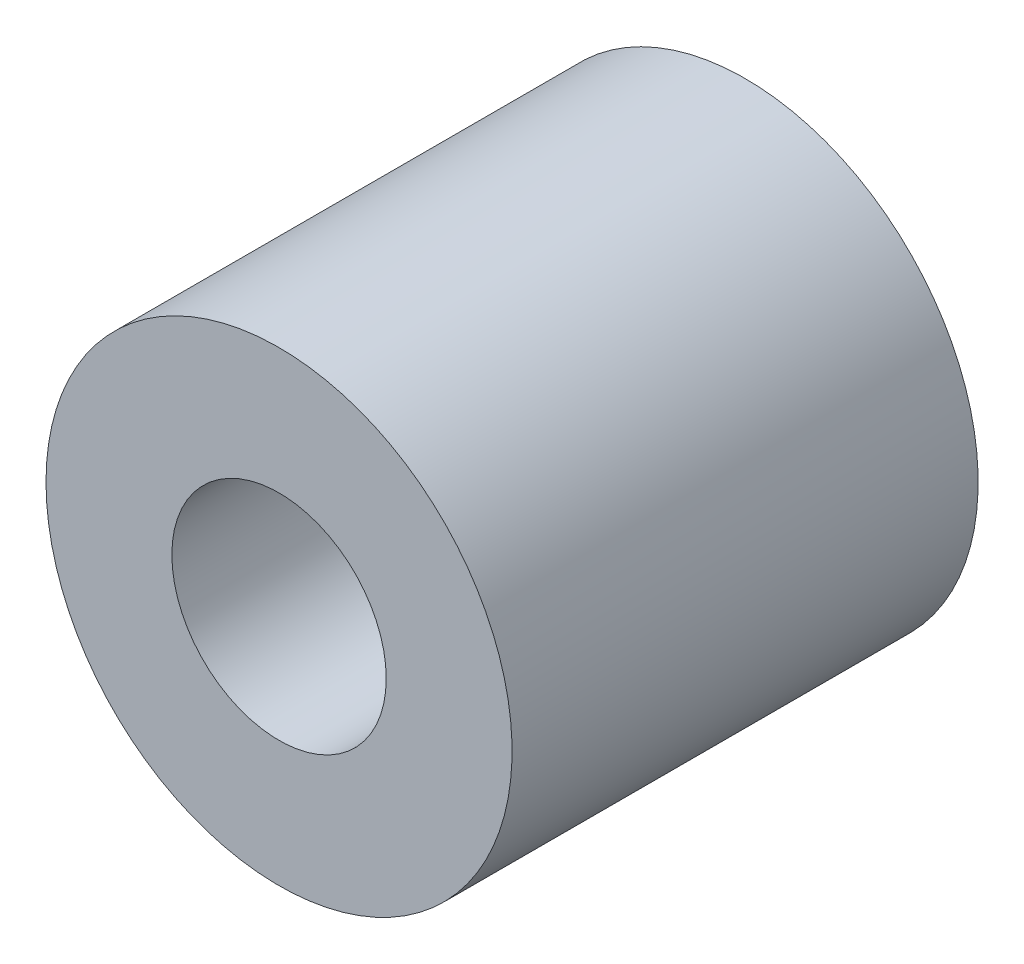
ISO-10303-21;
HEADER;
FILE_DESCRIPTION(('STEP AP214'),'2;1');
FILE_NAME('part.step','',(''),(''),'','','');
FILE_SCHEMA(('AUTOMOTIVE_DESIGN { 1 0 10303 214 1 1 1 1 }'));
ENDSEC;
DATA;
#1=APPLICATION_CONTEXT('core data for automotive mechanical design processes');
#2=APPLICATION_PROTOCOL_DEFINITION('international standard','automotive_design',2000,#1);
#3=PRODUCT_CONTEXT('',#1,'mechanical');
#4=PRODUCT('Part','Part','',(#3));
#5=PRODUCT_RELATED_PRODUCT_CATEGORY('part','',(#4));
#6=PRODUCT_DEFINITION_FORMATION('','',#4);
#7=PRODUCT_DEFINITION_CONTEXT('part definition',#1,'design');
#8=PRODUCT_DEFINITION('design','',#6,#7);
#9=PRODUCT_DEFINITION_SHAPE('','',#8);
#10=(LENGTH_UNIT() NAMED_UNIT(*) SI_UNIT(.MILLI.,.METRE.));
#11=(NAMED_UNIT(*) PLANE_ANGLE_UNIT() SI_UNIT($,.RADIAN.));
#12=(NAMED_UNIT(*) SI_UNIT($,.STERADIAN.) SOLID_ANGLE_UNIT());
#13=UNCERTAINTY_MEASURE_WITH_UNIT(LENGTH_MEASURE(1.E-05),#10,'distance_accuracy_value','');
#14=(GEOMETRIC_REPRESENTATION_CONTEXT(3) GLOBAL_UNCERTAINTY_ASSIGNED_CONTEXT((#13)) GLOBAL_UNIT_ASSIGNED_CONTEXT((#10,
#11,#12)) REPRESENTATION_CONTEXT('',''));
#15=CARTESIAN_POINT('',(0.,0.,0.));
#16=DIRECTION('',(0.,0.,1.));
#17=DIRECTION('',(1.,0.,0.));
#18=AXIS2_PLACEMENT_3D('',#15,#16,#17);
#19=CARTESIAN_POINT('',(0.,0.,3.175));
#20=DIRECTION('',(0.,0.,-1.));
#21=DIRECTION('',(-1.,0.,0.));
#22=AXIS2_PLACEMENT_3D('',#19,#20,#21);
#23=CYLINDRICAL_SURFACE('',#22,1.4605);
#24=CARTESIAN_POINT('',(0.,0.,-3.175));
#25=DIRECTION('',(0.,0.,-1.));
#26=DIRECTION('',(-1.,0.,0.));
#27=AXIS2_PLACEMENT_3D('',#24,#25,#26);
#28=CIRCLE('',#27,1.4605);
#29=CARTESIAN_POINT('',(-1.4605,0.,-3.175));
#30=VERTEX_POINT('',#29);
#31=EDGE_CURVE('E27',#30,#30,#28,.T.);
#32=ORIENTED_EDGE('',*,*,#31,.T.);
#33=EDGE_LOOP('',(#32));
#34=FACE_BOUND('',#33,.T.);
#35=CARTESIAN_POINT('',(0.,0.,3.175));
#36=DIRECTION('',(0.,0.,-1.));
#37=DIRECTION('',(-1.,0.,0.));
#38=AXIS2_PLACEMENT_3D('',#35,#36,#37);
#39=CIRCLE('',#38,1.4605);
#40=CARTESIAN_POINT('',(-1.4605,0.,3.175));
#41=VERTEX_POINT('',#40);
#42=EDGE_CURVE('E18',#41,#41,#39,.T.);
#43=ORIENTED_EDGE('',*,*,#42,.F.);
#44=EDGE_LOOP('',(#43));
#45=FACE_BOUND('',#44,.T.);
#46=ADVANCED_FACE('F15',(#34,#45),#23,.F.);
#47=CARTESIAN_POINT('',(0.,0.,3.175));
#48=DIRECTION('',(0.,0.,1.));
#49=DIRECTION('',(1.,0.,0.));
#50=AXIS2_PLACEMENT_3D('',#47,#48,#49);
#51=PLANE('',#50);
#52=ORIENTED_EDGE('',*,*,#42,.T.);
#53=EDGE_LOOP('',(#52));
#54=FACE_BOUND('',#53,.T.);
#55=CARTESIAN_POINT('',(0.,0.,3.175));
#56=DIRECTION('',(0.,0.,-1.));
#57=DIRECTION('',(-1.,0.,0.));
#58=AXIS2_PLACEMENT_3D('',#55,#56,#57);
#59=CIRCLE('',#58,3.175);
#60=CARTESIAN_POINT('',(-3.175,0.,3.175));
#61=VERTEX_POINT('',#60);
#62=EDGE_CURVE('E22',#61,#61,#59,.T.);
#63=ORIENTED_EDGE('',*,*,#62,.F.);
#64=EDGE_LOOP('',(#63));
#65=FACE_BOUND('',#64,.T.);
#66=ADVANCED_FACE('F35',(#54,#65),#51,.T.);
#67=CARTESIAN_POINT('',(0.,0.,-3.175));
#68=DIRECTION('',(0.,0.,1.));
#69=DIRECTION('',(1.,0.,0.));
#70=AXIS2_PLACEMENT_3D('',#67,#68,#69);
#71=PLANE('',#70);
#72=ORIENTED_EDGE('',*,*,#31,.F.);
#73=EDGE_LOOP('',(#72));
#74=FACE_BOUND('',#73,.T.);
#75=CARTESIAN_POINT('',(0.,0.,-3.175));
#76=DIRECTION('',(0.,0.,-1.));
#77=DIRECTION('',(-1.,0.,0.));
#78=AXIS2_PLACEMENT_3D('',#75,#76,#77);
#79=CIRCLE('',#78,3.175);
#80=CARTESIAN_POINT('',(-3.175,0.,-3.175));
#81=VERTEX_POINT('',#80);
#82=EDGE_CURVE('E10',#81,#81,#79,.F.);
#83=ORIENTED_EDGE('',*,*,#82,.F.);
#84=EDGE_LOOP('',(#83));
#85=FACE_BOUND('',#84,.T.);
#86=ADVANCED_FACE('F43',(#74,#85),#71,.F.);
#87=CARTESIAN_POINT('',(0.,0.,3.175));
#88=DIRECTION('',(0.,0.,-1.));
#89=DIRECTION('',(-1.,0.,0.));
#90=AXIS2_PLACEMENT_3D('',#87,#88,#89);
#91=CYLINDRICAL_SURFACE('',#90,3.175);
#92=ORIENTED_EDGE('',*,*,#82,.T.);
#93=EDGE_LOOP('',(#92));
#94=FACE_BOUND('',#93,.T.);
#95=ORIENTED_EDGE('',*,*,#62,.T.);
#96=EDGE_LOOP('',(#95));
#97=FACE_BOUND('',#96,.T.);
#98=ADVANCED_FACE('F44',(#94,#97),#91,.T.);
#99=CLOSED_SHELL('',(#46,#66,#86,#98));
#100=MANIFOLD_SOLID_BREP('B1',#99);
#101=ADVANCED_BREP_SHAPE_REPRESENTATION('',(#18,#100),#14);
#102=SHAPE_DEFINITION_REPRESENTATION(#9,#101);
ENDSEC;
END-ISO-10303-21;
